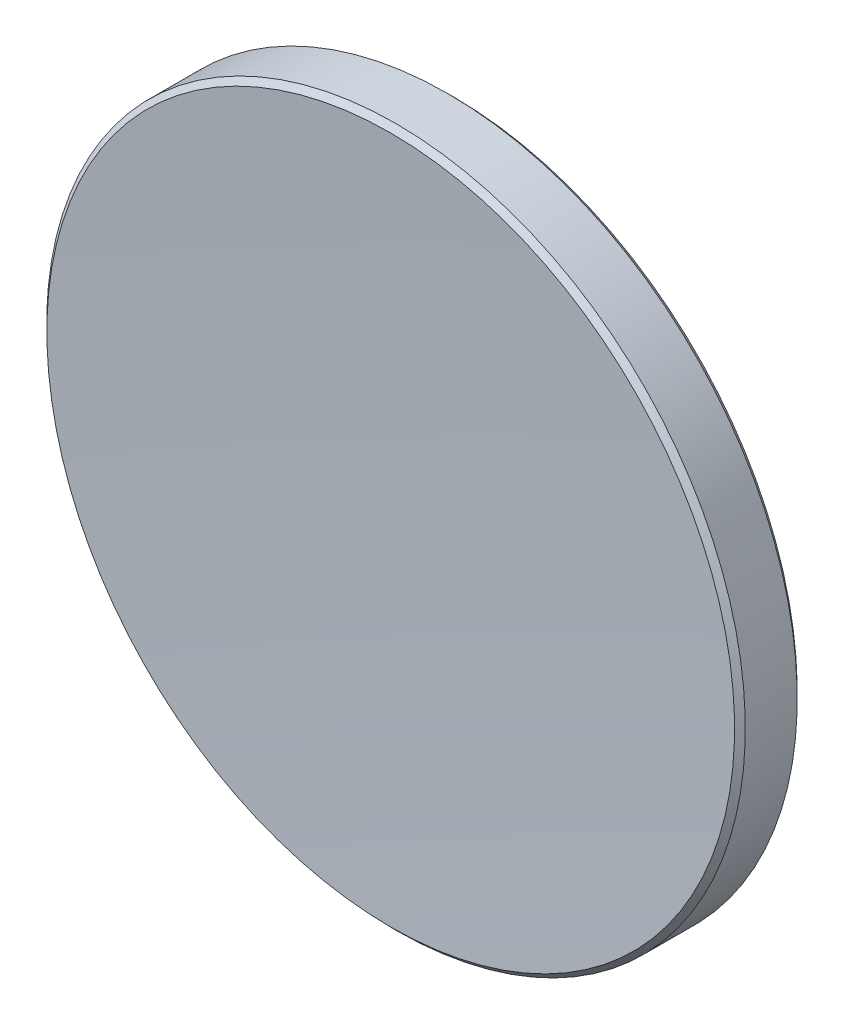
ISO-10303-21;
HEADER;
FILE_DESCRIPTION(('STEP AP214'),'2;1');
FILE_NAME('part.step','',(''),(''),'','','');
FILE_SCHEMA(('AUTOMOTIVE_DESIGN { 1 0 10303 214 1 1 1 1 }'));
ENDSEC;
DATA;
#1=APPLICATION_CONTEXT('core data for automotive mechanical design processes');
#2=APPLICATION_PROTOCOL_DEFINITION('international standard','automotive_design',2000,#1);
#3=PRODUCT_CONTEXT('',#1,'mechanical');
#4=PRODUCT('Part','Part','',(#3));
#5=PRODUCT_RELATED_PRODUCT_CATEGORY('part','',(#4));
#6=PRODUCT_DEFINITION_FORMATION('','',#4);
#7=PRODUCT_DEFINITION_CONTEXT('part definition',#1,'design');
#8=PRODUCT_DEFINITION('design','',#6,#7);
#9=PRODUCT_DEFINITION_SHAPE('','',#8);
#10=(LENGTH_UNIT() NAMED_UNIT(*) SI_UNIT(.MILLI.,.METRE.));
#11=(NAMED_UNIT(*) PLANE_ANGLE_UNIT() SI_UNIT($,.RADIAN.));
#12=(NAMED_UNIT(*) SI_UNIT($,.STERADIAN.) SOLID_ANGLE_UNIT());
#13=UNCERTAINTY_MEASURE_WITH_UNIT(LENGTH_MEASURE(1.E-05),#10,'distance_accuracy_value','');
#14=(GEOMETRIC_REPRESENTATION_CONTEXT(3) GLOBAL_UNCERTAINTY_ASSIGNED_CONTEXT((#13)) GLOBAL_UNIT_ASSIGNED_CONTEXT((#10,
#11,#12)) REPRESENTATION_CONTEXT('',''));
#15=CARTESIAN_POINT('',(0.,0.,0.));
#16=DIRECTION('',(0.,0.,1.));
#17=DIRECTION('',(1.,0.,0.));
#18=AXIS2_PLACEMENT_3D('',#15,#16,#17);
#19=CARTESIAN_POINT('',(0.,0.,-1.));
#20=DIRECTION('',(0.,0.,-1.));
#21=DIRECTION('',(0.,1.,0.));
#22=AXIS2_PLACEMENT_3D('',#19,#20,#21);
#23=PLANE('',#22);
#24=CARTESIAN_POINT('',(0.,0.,-1.));
#25=DIRECTION('',(0.,0.,-1.));
#26=DIRECTION('',(0.,1.,0.));
#27=AXIS2_PLACEMENT_3D('',#24,#25,#26);
#28=CIRCLE('',#27,12.5);
#29=CARTESIAN_POINT('',(0.,12.5,-0.999999999999998));
#30=VERTEX_POINT('',#29);
#31=EDGE_CURVE('E28',#30,#30,#28,.T.);
#32=ORIENTED_EDGE('',*,*,#31,.T.);
#33=EDGE_LOOP('',(#32));
#34=FACE_BOUND('',#33,.T.);
#35=ADVANCED_FACE('F13',(#34),#23,.T.);
#36=CARTESIAN_POINT('',(0.,0.,-1.));
#37=DIRECTION('',(0.,0.,-1.));
#38=DIRECTION('',(0.,1.,0.));
#39=AXIS2_PLACEMENT_3D('',#36,#37,#38);
#40=CYLINDRICAL_SURFACE('',#39,12.7);
#41=CARTESIAN_POINT('',(0.,0.,-0.8));
#42=DIRECTION('',(0.,0.,-1.));
#43=DIRECTION('',(0.,1.,0.));
#44=AXIS2_PLACEMENT_3D('',#41,#42,#43);
#45=CIRCLE('',#44,12.7);
#46=CARTESIAN_POINT('',(0.,12.7,-0.799999999999996));
#47=VERTEX_POINT('',#46);
#48=EDGE_CURVE('E20',#47,#47,#45,.F.);
#49=ORIENTED_EDGE('',*,*,#48,.T.);
#50=EDGE_LOOP('',(#49));
#51=FACE_BOUND('',#50,.T.);
#52=CARTESIAN_POINT('',(0.,0.,1.08761910361171));
#53=DIRECTION('',(0.,0.,1.));
#54=DIRECTION('',(0.,-1.,0.));
#55=AXIS2_PLACEMENT_3D('',#52,#53,#54);
#56=CIRCLE('',#55,12.7);
#57=CARTESIAN_POINT('',(0.,-12.7,1.08761910361171));
#58=VERTEX_POINT('',#57);
#59=EDGE_CURVE('E24',#58,#58,#56,.F.);
#60=ORIENTED_EDGE('',*,*,#59,.T.);
#61=EDGE_LOOP('',(#60));
#62=FACE_BOUND('',#61,.T.);
#63=ADVANCED_FACE('F45',(#51,#62),#40,.T.);
#64=CARTESIAN_POINT('',(0.,0.,281.532));
#65=DIRECTION('',(0.,0.,-1.));
#66=DIRECTION('',(0.,1.,0.));
#67=AXIS2_PLACEMENT_3D('',#64,#65,#66);
#68=SPHERICAL_SURFACE('',#67,280.532);
#69=CARTESIAN_POINT('',(0.,0.,1.27863305999293));
#70=DIRECTION('',(0.,0.,1.));
#71=DIRECTION('',(0.,-1.,0.));
#72=AXIS2_PLACEMENT_3D('',#69,#70,#71);
#73=CIRCLE('',#72,12.500133710876);
#74=CARTESIAN_POINT('',(0.,-12.500133710876,1.27863305999292));
#75=VERTEX_POINT('',#74);
#76=EDGE_CURVE('E9',#75,#75,#73,.T.);
#77=ORIENTED_EDGE('',*,*,#76,.T.);
#78=EDGE_LOOP('',(#77));
#79=FACE_BOUND('',#78,.T.);
#80=ADVANCED_FACE('F37',(#79),#68,.F.);
#81=CARTESIAN_POINT('',(0.,0.,-1.));
#82=DIRECTION('',(0.,0.,1.));
#83=DIRECTION('',(0.,-1.,0.));
#84=AXIS2_PLACEMENT_3D('',#81,#82,#83);
#85=CONICAL_SURFACE('',#84,12.5,0.785398163397448);
#86=ORIENTED_EDGE('',*,*,#48,.F.);
#87=EDGE_LOOP('',(#86));
#88=FACE_BOUND('',#87,.T.);
#89=ORIENTED_EDGE('',*,*,#31,.F.);
#90=EDGE_LOOP('',(#89));
#91=FACE_BOUND('',#90,.T.);
#92=ADVANCED_FACE('F35',(#88,#91),#85,.T.);
#93=CARTESIAN_POINT('',(0.,0.,1.08761910361171));
#94=DIRECTION('',(0.,0.,-1.));
#95=DIRECTION('',(0.,1.,0.));
#96=AXIS2_PLACEMENT_3D('',#93,#94,#95);
#97=CONICAL_SURFACE('',#96,12.7,0.80804146623138);
#98=ORIENTED_EDGE('',*,*,#76,.F.);
#99=EDGE_LOOP('',(#98));
#100=FACE_BOUND('',#99,.T.);
#101=ORIENTED_EDGE('',*,*,#59,.F.);
#102=EDGE_LOOP('',(#101));
#103=FACE_BOUND('',#102,.T.);
#104=ADVANCED_FACE('F15',(#100,#103),#97,.T.);
#105=CLOSED_SHELL('',(#35,#63,#80,#92,#104));
#106=MANIFOLD_SOLID_BREP('B1',#105);
#107=ADVANCED_BREP_SHAPE_REPRESENTATION('',(#18,#106),#14);
#108=SHAPE_DEFINITION_REPRESENTATION(#9,#107);
ENDSEC;
END-ISO-10303-21;
